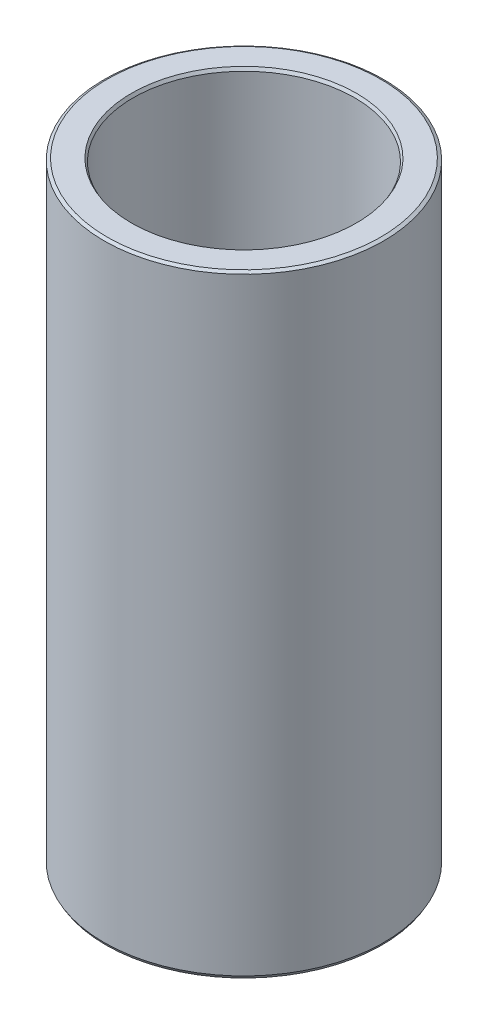
ISO-10303-21;
HEADER;
FILE_DESCRIPTION(('STEP AP214'),'2;1');
FILE_NAME('part.step','',(''),(''),'','','');
FILE_SCHEMA(('AUTOMOTIVE_DESIGN { 1 0 10303 214 1 1 1 1 }'));
ENDSEC;
DATA;
#1=APPLICATION_CONTEXT('core data for automotive mechanical design processes');
#2=APPLICATION_PROTOCOL_DEFINITION('international standard','automotive_design',2000,#1);
#3=PRODUCT_CONTEXT('',#1,'mechanical');
#4=PRODUCT('Part','Part','',(#3));
#5=PRODUCT_RELATED_PRODUCT_CATEGORY('part','',(#4));
#6=PRODUCT_DEFINITION_FORMATION('','',#4);
#7=PRODUCT_DEFINITION_CONTEXT('part definition',#1,'design');
#8=PRODUCT_DEFINITION('design','',#6,#7);
#9=PRODUCT_DEFINITION_SHAPE('','',#8);
#10=(LENGTH_UNIT() NAMED_UNIT(*) SI_UNIT(.MILLI.,.METRE.));
#11=(NAMED_UNIT(*) PLANE_ANGLE_UNIT() SI_UNIT($,.RADIAN.));
#12=(NAMED_UNIT(*) SI_UNIT($,.STERADIAN.) SOLID_ANGLE_UNIT());
#13=UNCERTAINTY_MEASURE_WITH_UNIT(LENGTH_MEASURE(1.E-05),#10,'distance_accuracy_value','');
#14=(GEOMETRIC_REPRESENTATION_CONTEXT(3) GLOBAL_UNCERTAINTY_ASSIGNED_CONTEXT((#13)) GLOBAL_UNIT_ASSIGNED_CONTEXT((#10,
#11,#12)) REPRESENTATION_CONTEXT('',''));
#15=CARTESIAN_POINT('',(0.,0.,0.));
#16=DIRECTION('',(0.,0.,1.));
#17=DIRECTION('',(1.,0.,0.));
#18=AXIS2_PLACEMENT_3D('',#15,#16,#17);
#19=CARTESIAN_POINT('',(0.,219.004814429411,0.));
#20=DIRECTION('',(0.,-1.,0.));
#21=DIRECTION('',(0.,0.,-1.));
#22=AXIS2_PLACEMENT_3D('',#19,#20,#21);
#23=CYLINDRICAL_SURFACE('',#22,50.);
#24=CARTESIAN_POINT('',(0.,1.08302242226788,0.));
#25=DIRECTION('',(0.,1.,0.));
#26=DIRECTION('',(0.,0.,1.));
#27=AXIS2_PLACEMENT_3D('',#24,#25,#26);
#28=CIRCLE('',#27,50.);
#29=CARTESIAN_POINT('',(0.,1.08302242226788,50.));
#30=VERTEX_POINT('',#29);
#31=EDGE_CURVE('E10',#30,#30,#28,.T.);
#32=ORIENTED_EDGE('',*,*,#31,.T.);
#33=EDGE_LOOP('',(#32));
#34=FACE_BOUND('',#33,.T.);
#35=CARTESIAN_POINT('',(0.,218.379531142376,0.));
#36=DIRECTION('',(0.,1.,0.));
#37=DIRECTION('',(0.,0.,1.));
#38=AXIS2_PLACEMENT_3D('',#35,#36,#37);
#39=CIRCLE('',#38,50.);
#40=CARTESIAN_POINT('',(0.,218.379531142376,50.));
#41=VERTEX_POINT('',#40);
#42=EDGE_CURVE('E50',#41,#41,#39,.F.);
#43=ORIENTED_EDGE('',*,*,#42,.T.);
#44=EDGE_LOOP('',(#43));
#45=FACE_BOUND('',#44,.T.);
#46=ADVANCED_FACE('F39',(#34,#45),#23,.T.);
#47=CARTESIAN_POINT('',(0.,219.004814429411,0.));
#48=DIRECTION('',(0.,1.,0.));
#49=DIRECTION('',(0.,0.,1.));
#50=AXIS2_PLACEMENT_3D('',#47,#48,#49);
#51=PLANE('',#50);
#52=CARTESIAN_POINT('',(0.,219.004814429411,0.));
#53=DIRECTION('',(0.,1.,0.));
#54=DIRECTION('',(0.,0.,1.));
#55=AXIS2_PLACEMENT_3D('',#52,#53,#54);
#56=CIRCLE('',#55,40.2189032680959);
#57=CARTESIAN_POINT('',(0.,219.004814429411,40.2189032680959));
#58=VERTEX_POINT('',#57);
#59=EDGE_CURVE('E58',#58,#58,#56,.F.);
#60=ORIENTED_EDGE('',*,*,#59,.T.);
#61=EDGE_LOOP('',(#60));
#62=FACE_BOUND('',#61,.T.);
#63=CARTESIAN_POINT('',(0.,219.004814429411,0.));
#64=DIRECTION('',(0.,1.,0.));
#65=DIRECTION('',(0.,0.,1.));
#66=AXIS2_PLACEMENT_3D('',#63,#64,#65);
#67=CIRCLE('',#66,48.9169775777321);
#68=CARTESIAN_POINT('',(0.,219.004814429411,48.9169775777321));
#69=VERTEX_POINT('',#68);
#70=EDGE_CURVE('E61',#69,#69,#67,.T.);
#71=ORIENTED_EDGE('',*,*,#70,.T.);
#72=EDGE_LOOP('',(#71));
#73=FACE_BOUND('',#72,.T.);
#74=ADVANCED_FACE('F88',(#62,#73),#51,.T.);
#75=CARTESIAN_POINT('',(0.,0.,0.));
#76=DIRECTION('',(0.,1.,0.));
#77=DIRECTION('',(0.,0.,1.));
#78=AXIS2_PLACEMENT_3D('',#75,#76,#77);
#79=PLANE('',#78);
#80=CARTESIAN_POINT('',(0.,0.,0.));
#81=DIRECTION('',(0.,1.,0.));
#82=DIRECTION('',(0.,0.,1.));
#83=AXIS2_PLACEMENT_3D('',#80,#81,#82);
#84=CIRCLE('',#83,40.6766424033291);
#85=CARTESIAN_POINT('',(0.,0.,40.6766424033291));
#86=VERTEX_POINT('',#85);
#87=EDGE_CURVE('E51',#86,#86,#84,.T.);
#88=ORIENTED_EDGE('',*,*,#87,.T.);
#89=EDGE_LOOP('',(#88));
#90=FACE_BOUND('',#89,.T.);
#91=CARTESIAN_POINT('',(0.,0.,0.));
#92=DIRECTION('',(0.,1.,0.));
#93=DIRECTION('',(0.,0.,1.));
#94=AXIS2_PLACEMENT_3D('',#91,#92,#93);
#95=CIRCLE('',#94,49.3747167129652);
#96=CARTESIAN_POINT('',(0.,0.,49.3747167129652));
#97=VERTEX_POINT('',#96);
#98=EDGE_CURVE('E54',#97,#97,#95,.F.);
#99=ORIENTED_EDGE('',*,*,#98,.T.);
#100=EDGE_LOOP('',(#99));
#101=FACE_BOUND('',#100,.T.);
#102=ADVANCED_FACE('F83',(#90,#101),#79,.F.);
#103=CARTESIAN_POINT('',(0.,219.004814429411,0.));
#104=DIRECTION('',(0.,-1.,0.));
#105=DIRECTION('',(0.,0.,-1.));
#106=AXIS2_PLACEMENT_3D('',#103,#104,#105);
#107=CYLINDRICAL_SURFACE('',#106,39.5936199810611);
#108=CARTESIAN_POINT('',(0.,217.921792007143,0.));
#109=DIRECTION('',(0.,1.,0.));
#110=DIRECTION('',(0.,0.,1.));
#111=AXIS2_PLACEMENT_3D('',#108,#109,#110);
#112=CIRCLE('',#111,39.5936199810611);
#113=CARTESIAN_POINT('',(0.,217.921792007143,39.5936199810611));
#114=VERTEX_POINT('',#113);
#115=EDGE_CURVE('E67',#114,#114,#112,.T.);
#116=ORIENTED_EDGE('',*,*,#115,.T.);
#117=EDGE_LOOP('',(#116));
#118=FACE_BOUND('',#117,.T.);
#119=CARTESIAN_POINT('',(0.,0.625283287034789,0.));
#120=DIRECTION('',(0.,1.,0.));
#121=DIRECTION('',(0.,0.,1.));
#122=AXIS2_PLACEMENT_3D('',#119,#120,#121);
#123=CIRCLE('',#122,39.5936199810611);
#124=CARTESIAN_POINT('',(0.,0.625283287034789,39.5936199810611));
#125=VERTEX_POINT('',#124);
#126=EDGE_CURVE('E69',#125,#125,#123,.F.);
#127=ORIENTED_EDGE('',*,*,#126,.T.);
#128=EDGE_LOOP('',(#127));
#129=FACE_BOUND('',#128,.T.);
#130=ADVANCED_FACE('F71',(#118,#129),#107,.F.);
#131=CARTESIAN_POINT('',(0.,217.921792007143,0.));
#132=DIRECTION('',(0.,1.,0.));
#133=DIRECTION('',(0.,0.,1.));
#134=AXIS2_PLACEMENT_3D('',#131,#132,#133);
#135=CONICAL_SURFACE('',#134,39.5936199810611,0.523598775598289);
#136=ORIENTED_EDGE('',*,*,#59,.F.);
#137=EDGE_LOOP('',(#136));
#138=FACE_BOUND('',#137,.T.);
#139=ORIENTED_EDGE('',*,*,#115,.F.);
#140=EDGE_LOOP('',(#139));
#141=FACE_BOUND('',#140,.T.);
#142=ADVANCED_FACE('F77',(#138,#141),#135,.F.);
#143=CARTESIAN_POINT('',(0.,0.,0.));
#144=DIRECTION('',(0.,-1.,0.));
#145=DIRECTION('',(0.,0.,-1.));
#146=AXIS2_PLACEMENT_3D('',#143,#144,#145);
#147=CONICAL_SURFACE('',#146,40.6766424033291,1.0471975511966);
#148=ORIENTED_EDGE('',*,*,#126,.F.);
#149=EDGE_LOOP('',(#148));
#150=FACE_BOUND('',#149,.T.);
#151=ORIENTED_EDGE('',*,*,#87,.F.);
#152=EDGE_LOOP('',(#151));
#153=FACE_BOUND('',#152,.T.);
#154=ADVANCED_FACE('F73',(#150,#153),#147,.F.);
#155=CARTESIAN_POINT('',(0.,1.08302242226788,0.));
#156=DIRECTION('',(0.,1.,0.));
#157=DIRECTION('',(0.,0.,1.));
#158=AXIS2_PLACEMENT_3D('',#155,#156,#157);
#159=CONICAL_SURFACE('',#158,50.,0.5235987755983);
#160=ORIENTED_EDGE('',*,*,#98,.F.);
#161=EDGE_LOOP('',(#160));
#162=FACE_BOUND('',#161,.T.);
#163=ORIENTED_EDGE('',*,*,#31,.F.);
#164=EDGE_LOOP('',(#163));
#165=FACE_BOUND('',#164,.T.);
#166=ADVANCED_FACE('F76',(#162,#165),#159,.T.);
#167=CARTESIAN_POINT('',(0.,219.004814429411,0.));
#168=DIRECTION('',(0.,-1.,0.));
#169=DIRECTION('',(0.,0.,-1.));
#170=AXIS2_PLACEMENT_3D('',#167,#168,#169);
#171=CONICAL_SURFACE('',#170,48.9169775777321,1.04719755119659);
#172=ORIENTED_EDGE('',*,*,#42,.F.);
#173=EDGE_LOOP('',(#172));
#174=FACE_BOUND('',#173,.T.);
#175=ORIENTED_EDGE('',*,*,#70,.F.);
#176=EDGE_LOOP('',(#175));
#177=FACE_BOUND('',#176,.T.);
#178=ADVANCED_FACE('F45',(#174,#177),#171,.T.);
#179=CLOSED_SHELL('',(#46,#74,#102,#130,#142,#154,#166,#178));
#180=MANIFOLD_SOLID_BREP('B2',#179);
#181=ADVANCED_BREP_SHAPE_REPRESENTATION('',(#18,#180),#14);
#182=SHAPE_DEFINITION_REPRESENTATION(#9,#181);
ENDSEC;
END-ISO-10303-21;
